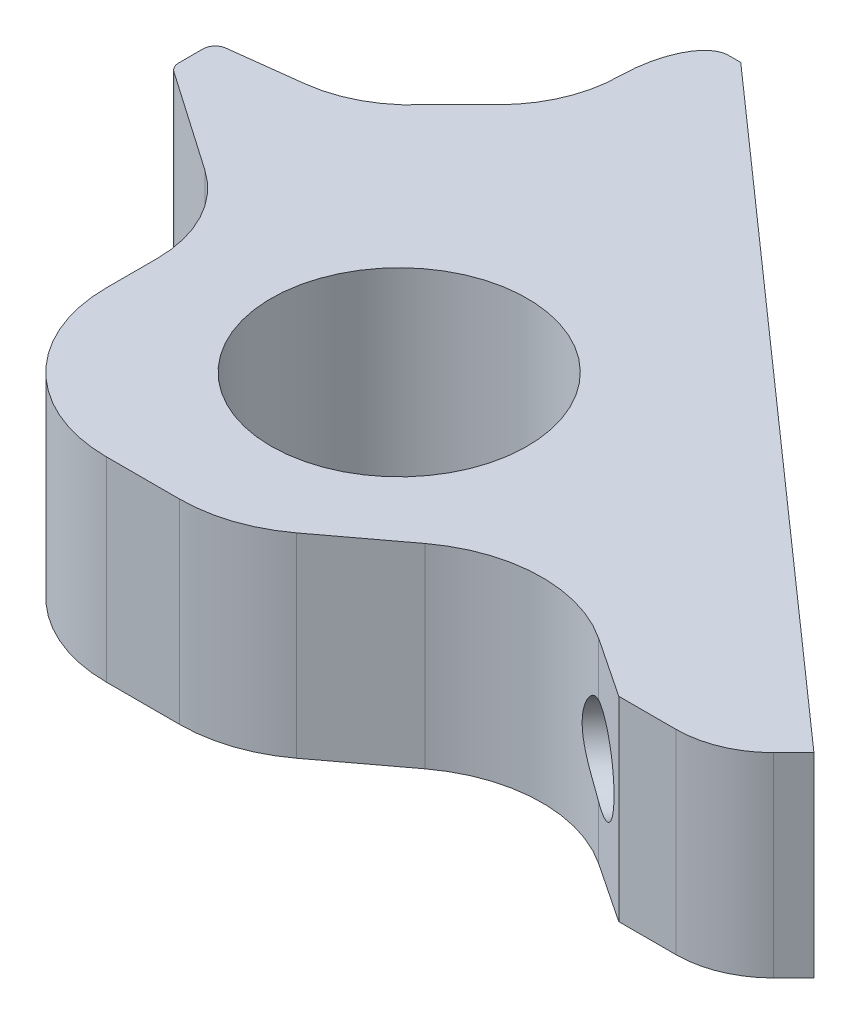
ISO-10303-21;
HEADER;
FILE_DESCRIPTION(('STEP AP214'),'2;1');
FILE_NAME('part.step','',(''),(''),'','','');
FILE_SCHEMA(('AUTOMOTIVE_DESIGN { 1 0 10303 214 1 1 1 1 }'));
ENDSEC;
DATA;
#1=APPLICATION_CONTEXT('core data for automotive mechanical design processes');
#2=APPLICATION_PROTOCOL_DEFINITION('international standard','automotive_design',2000,#1);
#3=PRODUCT_CONTEXT('',#1,'mechanical');
#4=PRODUCT('Part','Part','',(#3));
#5=PRODUCT_RELATED_PRODUCT_CATEGORY('part','',(#4));
#6=PRODUCT_DEFINITION_FORMATION('','',#4);
#7=PRODUCT_DEFINITION_CONTEXT('part definition',#1,'design');
#8=PRODUCT_DEFINITION('design','',#6,#7);
#9=PRODUCT_DEFINITION_SHAPE('','',#8);
#10=(LENGTH_UNIT() NAMED_UNIT(*) SI_UNIT(.MILLI.,.METRE.));
#11=(NAMED_UNIT(*) PLANE_ANGLE_UNIT() SI_UNIT($,.RADIAN.));
#12=(NAMED_UNIT(*) SI_UNIT($,.STERADIAN.) SOLID_ANGLE_UNIT());
#13=UNCERTAINTY_MEASURE_WITH_UNIT(LENGTH_MEASURE(1.E-05),#10,'distance_accuracy_value','');
#14=(GEOMETRIC_REPRESENTATION_CONTEXT(3) GLOBAL_UNCERTAINTY_ASSIGNED_CONTEXT((#13)) GLOBAL_UNIT_ASSIGNED_CONTEXT((#10,
#11,#12)) REPRESENTATION_CONTEXT('',''));
#15=CARTESIAN_POINT('',(0.,0.,0.));
#16=DIRECTION('',(0.,0.,1.));
#17=DIRECTION('',(1.,0.,0.));
#18=AXIS2_PLACEMENT_3D('',#15,#16,#17);
#19=CARTESIAN_POINT('',(0.,8.,0.));
#20=DIRECTION('',(0.,-1.,0.));
#21=DIRECTION('',(0.,0.,-1.));
#22=AXIS2_PLACEMENT_3D('',#19,#20,#21);
#23=PLANE('',#22);
#24=DIRECTION('',(1.,0.,0.));
#25=VECTOR('',#24,1.);
#26=CARTESIAN_POINT('',(20.,8.,7.));
#27=LINE('',#26,#25);
#28=CARTESIAN_POINT('',(16.,8.,7.));
#29=VERTEX_POINT('',#28);
#30=CARTESIAN_POINT('',(18.3431457505076,8.,7.));
#31=VERTEX_POINT('',#30);
#32=EDGE_CURVE('E487',#29,#31,#27,.T.);
#33=ORIENTED_EDGE('',*,*,#32,.T.);
#34=CARTESIAN_POINT('',(18.3431457505076,8.,3.));
#35=DIRECTION('',(0.,-1.,0.));
#36=DIRECTION('',(0.,0.,-1.));
#37=AXIS2_PLACEMENT_3D('',#34,#35,#36);
#38=CIRCLE('',#37,4.);
#39=CARTESIAN_POINT('',(21.1715728752538,8.,5.82842712474619));
#40=VERTEX_POINT('',#39);
#41=EDGE_CURVE('E12',#31,#40,#38,.F.);
#42=ORIENTED_EDGE('',*,*,#41,.T.);
#43=DIRECTION('',(0.707106781186547,0.,-0.707106781186548));
#44=VECTOR('',#43,1.);
#45=CARTESIAN_POINT('',(20.,8.,7.));
#46=LINE('',#45,#44);
#47=CARTESIAN_POINT('',(22.,8.,5.));
#48=VERTEX_POINT('',#47);
#49=EDGE_CURVE('E493',#40,#48,#46,.T.);
#50=ORIENTED_EDGE('',*,*,#49,.T.);
#51=DIRECTION('',(-0.748996562490381,0.,-0.662573882203029));
#52=VECTOR('',#51,1.);
#53=CARTESIAN_POINT('',(-4.,8.,-18.));
#54=LINE('',#53,#52);
#55=CARTESIAN_POINT('',(-4.,8.,-18.));
#56=VERTEX_POINT('',#55);
#57=EDGE_CURVE('E356',#48,#56,#54,.T.);
#58=ORIENTED_EDGE('',*,*,#57,.T.);
#59=DIRECTION('',(-1.,0.,0.));
#60=VECTOR('',#59,1.);
#61=CARTESIAN_POINT('',(-6.,8.,-18.));
#62=LINE('',#61,#60);
#63=CARTESIAN_POINT('',(-4.5,8.,-18.));
#64=VERTEX_POINT('',#63);
#65=EDGE_CURVE('E346',#56,#64,#62,.T.);
#66=ORIENTED_EDGE('',*,*,#65,.T.);
#67=CARTESIAN_POINT('',(-6.,8.,-15.));
#68=CARTESIAN_POINT('',(-6.,8.,-18.));
#69=CARTESIAN_POINT('',(-4.5,8.,-18.));
#70=(BOUNDED_CURVE() B_SPLINE_CURVE(2,(#67,#68,#69),.UNSPECIFIED.,.F.,
.F.) B_SPLINE_CURVE_WITH_KNOTS((3,3),(0.,1.),
.UNSPECIFIED.) CURVE() GEOMETRIC_REPRESENTATION_ITEM() RATIONAL_B_SPLINE_CURVE((1.,
0.707106781186548,1.)) REPRESENTATION_ITEM(''));
#71=CARTESIAN_POINT('',(-5.99987537465375,8.,-15.0388891972066));
#72=VERTEX_POINT('',#71);
#73=EDGE_CURVE('E332',#64,#72,#70,.F.);
#74=ORIENTED_EDGE('',*,*,#73,.T.);
#75=CARTESIAN_POINT('',(-10.9997689239918,8.,-15.0712988878737));
#76=DIRECTION('',(0.,-1.,0.));
#77=DIRECTION('',(0.,0.,-1.));
#78=AXIS2_PLACEMENT_3D('',#75,#76,#77);
#79=CIRCLE('',#78,5.);
#80=CARTESIAN_POINT('',(-7.46423501805903,8.,-11.535764981941));
#81=VERTEX_POINT('',#80);
#82=EDGE_CURVE('E406',#72,#81,#79,.T.);
#83=ORIENTED_EDGE('',*,*,#82,.T.);
#84=DIRECTION('',(-0.707106781186548,0.,0.707106781186547));
#85=VECTOR('',#84,1.);
#86=CARTESIAN_POINT('',(-9.00000000000001,8.,-10.));
#87=LINE('',#86,#85);
#88=CARTESIAN_POINT('',(-9.00000000000001,8.,-10.));
#89=VERTEX_POINT('',#88);
#90=EDGE_CURVE('E355',#81,#89,#87,.T.);
#91=ORIENTED_EDGE('',*,*,#90,.T.);
#92=CARTESIAN_POINT('',(-12.7794521093473,8.,-13.2734907595945));
#93=DIRECTION('',(0.,-1.,0.));
#94=DIRECTION('',(0.,0.,-1.));
#95=AXIS2_PLACEMENT_3D('',#92,#93,#94);
#96=CIRCLE('',#95,5.);
#97=CARTESIAN_POINT('',(-12.1701053923215,8.,-8.31076000138787));
#98=VERTEX_POINT('',#97);
#99=EDGE_CURVE('E440',#89,#98,#96,.T.);
#100=ORIENTED_EDGE('',*,*,#99,.T.);
#101=DIRECTION('',(0.992546151641322,0.,-0.121869343405148));
#102=VECTOR('',#101,1.);
#103=CARTESIAN_POINT('',(-15.5,8.,-7.90190035413112));
#104=LINE('',#103,#102);
#105=CARTESIAN_POINT('',(-15.0609346717026,8.,-7.95581079767381));
#106=VERTEX_POINT('',#105);
#107=EDGE_CURVE('E414',#98,#106,#104,.F.);
#108=ORIENTED_EDGE('',*,*,#107,.T.);
#109=CARTESIAN_POINT('',(-15.,8.,-7.45953772185315));
#110=DIRECTION('',(0.,-1.,0.));
#111=DIRECTION('',(0.,0.,-1.));
#112=AXIS2_PLACEMENT_3D('',#109,#110,#111);
#113=CIRCLE('',#112,0.5);
#114=CARTESIAN_POINT('',(-15.5,8.,-7.45953772185315));
#115=VERTEX_POINT('',#114);
#116=EDGE_CURVE('E454',#106,#115,#113,.F.);
#117=ORIENTED_EDGE('',*,*,#116,.T.);
#118=DIRECTION('',(0.,0.,1.));
#119=VECTOR('',#118,1.);
#120=CARTESIAN_POINT('',(-15.5,8.,-8.7));
#121=LINE('',#120,#119);
#122=CARTESIAN_POINT('',(-15.5,8.,-6.4619764731093));
#123=VERTEX_POINT('',#122);
#124=EDGE_CURVE('E390',#115,#123,#121,.T.);
#125=ORIENTED_EDGE('',*,*,#124,.T.);
#126=CARTESIAN_POINT('',(-15.,8.,-6.4619764731093));
#127=DIRECTION('',(0.,-1.,0.));
#128=DIRECTION('',(0.,0.,-1.));
#129=AXIS2_PLACEMENT_3D('',#126,#127,#128);
#130=CIRCLE('',#129,0.5);
#131=CARTESIAN_POINT('',(-15.2846049894152,8.,-6.05088037728741));
#132=VERTEX_POINT('',#131);
#133=EDGE_CURVE('E456',#123,#132,#130,.F.);
#134=ORIENTED_EDGE('',*,*,#133,.T.);
#135=DIRECTION('',(0.822192191643779,0.,0.569209978830308));
#136=VECTOR('',#135,1.);
#137=CARTESIAN_POINT('',(-15.5,8.,-6.2));
#138=LINE('',#137,#136);
#139=CARTESIAN_POINT('',(-11.1539501058485,8.,-3.19119622712585));
#140=VERTEX_POINT('',#139);
#141=EDGE_CURVE('E546',#132,#140,#138,.T.);
#142=ORIENTED_EDGE('',*,*,#141,.T.);
#143=CARTESIAN_POINT('',(-14.,8.,0.919764731093039));
#144=DIRECTION('',(0.,-1.,0.));
#145=DIRECTION('',(0.,0.,-1.));
#146=AXIS2_PLACEMENT_3D('',#143,#144,#145);
#147=CIRCLE('',#146,5.);
#148=CARTESIAN_POINT('',(-9.,8.,0.919764731093037));
#149=VERTEX_POINT('',#148);
#150=EDGE_CURVE('E436',#140,#149,#147,.T.);
#151=ORIENTED_EDGE('',*,*,#150,.T.);
#152=DIRECTION('',(0.,0.,1.));
#153=VECTOR('',#152,1.);
#154=CARTESIAN_POINT('',(-9.,8.,-1.7));
#155=LINE('',#154,#153);
#156=CARTESIAN_POINT('',(-9.,8.,3.));
#157=VERTEX_POINT('',#156);
#158=EDGE_CURVE('E489',#149,#157,#155,.T.);
#159=ORIENTED_EDGE('',*,*,#158,.T.);
#160=CARTESIAN_POINT('',(-3.,8.,3.));
#161=DIRECTION('',(0.,-1.,0.));
#162=DIRECTION('',(0.,0.,-1.));
#163=AXIS2_PLACEMENT_3D('',#160,#161,#162);
#164=CIRCLE('',#163,6.);
#165=CARTESIAN_POINT('',(-3.,8.,9.));
#166=VERTEX_POINT('',#165);
#167=EDGE_CURVE('E473',#157,#166,#164,.F.);
#168=ORIENTED_EDGE('',*,*,#167,.T.);
#169=DIRECTION('',(1.,0.,0.));
#170=VECTOR('',#169,1.);
#171=CARTESIAN_POINT('',(2.,8.,9.));
#172=LINE('',#171,#170);
#173=CARTESIAN_POINT('',(0.,8.,9.));
#174=VERTEX_POINT('',#173);
#175=EDGE_CURVE('E485',#166,#174,#172,.T.);
#176=ORIENTED_EDGE('',*,*,#175,.T.);
#177=CARTESIAN_POINT('',(0.,8.,3.));
#178=DIRECTION('',(0.,-1.,0.));
#179=DIRECTION('',(0.,0.,-1.));
#180=AXIS2_PLACEMENT_3D('',#177,#178,#179);
#181=CIRCLE('',#180,6.);
#182=CARTESIAN_POINT('',(3.6,8.,7.8));
#183=VERTEX_POINT('',#182);
#184=EDGE_CURVE('E471',#174,#183,#181,.F.);
#185=ORIENTED_EDGE('',*,*,#184,.T.);
#186=DIRECTION('',(0.8,0.,-0.6));
#187=VECTOR('',#186,1.);
#188=CARTESIAN_POINT('',(10.,8.,3.));
#189=LINE('',#188,#187);
#190=CARTESIAN_POINT('',(6.60392761110966,8.,5.54705429166775));
#191=VERTEX_POINT('',#190);
#192=EDGE_CURVE('E478',#183,#191,#189,.T.);
#193=ORIENTED_EDGE('',*,*,#192,.T.);
#194=CARTESIAN_POINT('',(10.2039276111097,8.,10.3470542916678));
#195=DIRECTION('',(0.,-1.,0.));
#196=DIRECTION('',(0.,0.,-1.));
#197=AXIS2_PLACEMENT_3D('',#194,#195,#196);
#198=CIRCLE('',#197,6.);
#199=CARTESIAN_POINT('',(13.532128788461,8.,5.35475252564069));
#200=VERTEX_POINT('',#199);
#201=EDGE_CURVE('E203',#191,#200,#198,.T.);
#202=ORIENTED_EDGE('',*,*,#201,.T.);
#203=DIRECTION('',(0.832050294337843,0.,0.554700196225229));
#204=VECTOR('',#203,1.);
#205=CARTESIAN_POINT('',(16.,8.,7.));
#206=LINE('',#205,#204);
#207=EDGE_CURVE('E484',#200,#29,#206,.T.);
#208=ORIENTED_EDGE('',*,*,#207,.T.);
#209=EDGE_LOOP('',(#33,#42,#50,#58,#66,#74,#83,#91,#100,#108,#117,#125,#134,#142,#151,#159,#168,
#176,#185,#193,#202,#208));
#210=FACE_BOUND('',#209,.T.);
#211=CARTESIAN_POINT('',(0.,8.,0.));
#212=DIRECTION('',(0.,1.,0.));
#213=DIRECTION('',(0.,0.,1.));
#214=AXIS2_PLACEMENT_3D('',#211,#212,#213);
#215=CIRCLE('',#214,5.25);
#216=CARTESIAN_POINT('',(0.,8.,5.25));
#217=VERTEX_POINT('',#216);
#218=EDGE_CURVE('E367',#217,#217,#215,.T.);
#219=ORIENTED_EDGE('',*,*,#218,.F.);
#220=EDGE_LOOP('',(#219));
#221=FACE_BOUND('',#220,.T.);
#222=ADVANCED_FACE('F40',(#210,#221),#23,.F.);
#223=CARTESIAN_POINT('',(0.,0.,0.));
#224=DIRECTION('',(0.,-1.,0.));
#225=DIRECTION('',(0.,0.,-1.));
#226=AXIS2_PLACEMENT_3D('',#223,#224,#225);
#227=PLANE('',#226);
#228=DIRECTION('',(0.707106781186547,0.,-0.707106781186548));
#229=VECTOR('',#228,1.);
#230=CARTESIAN_POINT('',(20.,0.,7.));
#231=LINE('',#230,#229);
#232=CARTESIAN_POINT('',(21.1715728752538,0.,5.82842712474619));
#233=VERTEX_POINT('',#232);
#234=CARTESIAN_POINT('',(22.,0.,5.));
#235=VERTEX_POINT('',#234);
#236=EDGE_CURVE('E382',#233,#235,#231,.T.);
#237=ORIENTED_EDGE('',*,*,#236,.F.);
#238=CARTESIAN_POINT('',(18.3431457505076,0.,3.));
#239=DIRECTION('',(0.,-1.,0.));
#240=DIRECTION('',(0.,0.,-1.));
#241=AXIS2_PLACEMENT_3D('',#238,#239,#240);
#242=CIRCLE('',#241,4.);
#243=CARTESIAN_POINT('',(18.3431457505076,0.,7.));
#244=VERTEX_POINT('',#243);
#245=EDGE_CURVE('E62',#233,#244,#242,.T.);
#246=ORIENTED_EDGE('',*,*,#245,.T.);
#247=DIRECTION('',(1.,0.,0.));
#248=VECTOR('',#247,1.);
#249=CARTESIAN_POINT('',(20.,0.,7.));
#250=LINE('',#249,#248);
#251=CARTESIAN_POINT('',(16.,0.,7.));
#252=VERTEX_POINT('',#251);
#253=EDGE_CURVE('E380',#252,#244,#250,.T.);
#254=ORIENTED_EDGE('',*,*,#253,.F.);
#255=DIRECTION('',(0.832050294337843,0.,0.554700196225229));
#256=VECTOR('',#255,1.);
#257=CARTESIAN_POINT('',(16.,0.,7.));
#258=LINE('',#257,#256);
#259=CARTESIAN_POINT('',(13.532128788461,0.,5.35475252564069));
#260=VERTEX_POINT('',#259);
#261=EDGE_CURVE('E378',#260,#252,#258,.T.);
#262=ORIENTED_EDGE('',*,*,#261,.F.);
#263=CARTESIAN_POINT('',(10.2039276111097,0.,10.3470542916678));
#264=DIRECTION('',(0.,-1.,0.));
#265=DIRECTION('',(0.,0.,-1.));
#266=AXIS2_PLACEMENT_3D('',#263,#264,#265);
#267=CIRCLE('',#266,6.);
#268=CARTESIAN_POINT('',(6.60392761110966,0.,5.54705429166775));
#269=VERTEX_POINT('',#268);
#270=EDGE_CURVE('E216',#260,#269,#267,.F.);
#271=ORIENTED_EDGE('',*,*,#270,.T.);
#272=DIRECTION('',(0.8,0.,-0.6));
#273=VECTOR('',#272,1.);
#274=CARTESIAN_POINT('',(10.,0.,3.));
#275=LINE('',#274,#273);
#276=CARTESIAN_POINT('',(3.6,0.,7.8));
#277=VERTEX_POINT('',#276);
#278=EDGE_CURVE('E375',#277,#269,#275,.T.);
#279=ORIENTED_EDGE('',*,*,#278,.F.);
#280=CARTESIAN_POINT('',(0.,0.,3.));
#281=DIRECTION('',(0.,-1.,0.));
#282=DIRECTION('',(0.,0.,-1.));
#283=AXIS2_PLACEMENT_3D('',#280,#281,#282);
#284=CIRCLE('',#283,6.);
#285=CARTESIAN_POINT('',(0.,0.,9.));
#286=VERTEX_POINT('',#285);
#287=EDGE_CURVE('E465',#277,#286,#284,.T.);
#288=ORIENTED_EDGE('',*,*,#287,.T.);
#289=DIRECTION('',(1.,0.,0.));
#290=VECTOR('',#289,1.);
#291=CARTESIAN_POINT('',(2.,0.,9.));
#292=LINE('',#291,#290);
#293=CARTESIAN_POINT('',(-3.,0.,9.));
#294=VERTEX_POINT('',#293);
#295=EDGE_CURVE('E372',#294,#286,#292,.T.);
#296=ORIENTED_EDGE('',*,*,#295,.F.);
#297=CARTESIAN_POINT('',(-3.,0.,3.));
#298=DIRECTION('',(0.,-1.,0.));
#299=DIRECTION('',(0.,0.,-1.));
#300=AXIS2_PLACEMENT_3D('',#297,#298,#299);
#301=CIRCLE('',#300,6.);
#302=CARTESIAN_POINT('',(-9.,0.,3.));
#303=VERTEX_POINT('',#302);
#304=EDGE_CURVE('E467',#294,#303,#301,.T.);
#305=ORIENTED_EDGE('',*,*,#304,.T.);
#306=DIRECTION('',(0.,0.,1.));
#307=VECTOR('',#306,1.);
#308=CARTESIAN_POINT('',(-9.,0.,-1.7));
#309=LINE('',#308,#307);
#310=CARTESIAN_POINT('',(-9.,0.,0.919764731093037));
#311=VERTEX_POINT('',#310);
#312=EDGE_CURVE('E369',#311,#303,#309,.T.);
#313=ORIENTED_EDGE('',*,*,#312,.F.);
#314=CARTESIAN_POINT('',(-14.,0.,0.919764731093039));
#315=DIRECTION('',(0.,-1.,0.));
#316=DIRECTION('',(0.,0.,-1.));
#317=AXIS2_PLACEMENT_3D('',#314,#315,#316);
#318=CIRCLE('',#317,5.);
#319=CARTESIAN_POINT('',(-11.1539501058485,0.,-3.19119622712585));
#320=VERTEX_POINT('',#319);
#321=EDGE_CURVE('E433',#311,#320,#318,.F.);
#322=ORIENTED_EDGE('',*,*,#321,.T.);
#323=DIRECTION('',(0.822192191643779,0.,0.569209978830308));
#324=VECTOR('',#323,1.);
#325=CARTESIAN_POINT('',(-15.5,0.,-6.2));
#326=LINE('',#325,#324);
#327=CARTESIAN_POINT('',(-15.2846049894152,0.,-6.05088037728741));
#328=VERTEX_POINT('',#327);
#329=EDGE_CURVE('E366',#328,#320,#326,.T.);
#330=ORIENTED_EDGE('',*,*,#329,.F.);
#331=CARTESIAN_POINT('',(-15.,0.,-6.4619764731093));
#332=DIRECTION('',(0.,-1.,0.));
#333=DIRECTION('',(0.,0.,-1.));
#334=AXIS2_PLACEMENT_3D('',#331,#332,#333);
#335=CIRCLE('',#334,0.5);
#336=CARTESIAN_POINT('',(-15.5,0.,-6.4619764731093));
#337=VERTEX_POINT('',#336);
#338=EDGE_CURVE('E447',#328,#337,#335,.T.);
#339=ORIENTED_EDGE('',*,*,#338,.T.);
#340=DIRECTION('',(0.,0.,1.));
#341=VECTOR('',#340,1.);
#342=CARTESIAN_POINT('',(-15.5,0.,-8.7));
#343=LINE('',#342,#341);
#344=CARTESIAN_POINT('',(-15.5,0.,-7.45953772185315));
#345=VERTEX_POINT('',#344);
#346=EDGE_CURVE('E363',#345,#337,#343,.T.);
#347=ORIENTED_EDGE('',*,*,#346,.F.);
#348=CARTESIAN_POINT('',(-15.,0.,-7.45953772185315));
#349=DIRECTION('',(0.,-1.,0.));
#350=DIRECTION('',(0.,0.,-1.));
#351=AXIS2_PLACEMENT_3D('',#348,#349,#350);
#352=CIRCLE('',#351,0.5);
#353=CARTESIAN_POINT('',(-15.0609346717026,0.,-7.95581079767381));
#354=VERTEX_POINT('',#353);
#355=EDGE_CURVE('E445',#345,#354,#352,.T.);
#356=ORIENTED_EDGE('',*,*,#355,.T.);
#357=DIRECTION('',(-0.992546151641322,0.,0.121869343405148));
#358=VECTOR('',#357,1.);
#359=CARTESIAN_POINT('',(-1.18602947761658,0.,-9.65943493949909));
#360=LINE('',#359,#358);
#361=CARTESIAN_POINT('',(-12.1701053923215,0.,-8.31076000138787));
#362=VERTEX_POINT('',#361);
#363=EDGE_CURVE('E411',#354,#362,#360,.F.);
#364=ORIENTED_EDGE('',*,*,#363,.T.);
#365=CARTESIAN_POINT('',(-12.7794521093473,0.,-13.2734907595945));
#366=DIRECTION('',(0.,-1.,0.));
#367=DIRECTION('',(0.,0.,-1.));
#368=AXIS2_PLACEMENT_3D('',#365,#366,#367);
#369=CIRCLE('',#368,5.);
#370=CARTESIAN_POINT('',(-9.00000000000001,0.,-10.));
#371=VERTEX_POINT('',#370);
#372=EDGE_CURVE('E438',#362,#371,#369,.F.);
#373=ORIENTED_EDGE('',*,*,#372,.T.);
#374=DIRECTION('',(-0.707106781186548,0.,0.707106781186547));
#375=VECTOR('',#374,1.);
#376=CARTESIAN_POINT('',(-9.00000000000001,0.,-10.));
#377=LINE('',#376,#375);
#378=CARTESIAN_POINT('',(-7.46423501805903,0.,-11.535764981941));
#379=VERTEX_POINT('',#378);
#380=EDGE_CURVE('E387',#379,#371,#377,.T.);
#381=ORIENTED_EDGE('',*,*,#380,.F.);
#382=CARTESIAN_POINT('',(-10.9997689239918,0.,-15.0712988878737));
#383=DIRECTION('',(0.,-1.,0.));
#384=DIRECTION('',(0.,0.,-1.));
#385=AXIS2_PLACEMENT_3D('',#382,#383,#384);
#386=CIRCLE('',#385,5.);
#387=CARTESIAN_POINT('',(-5.99987522622822,0.,-15.0388891963235));
#388=VERTEX_POINT('',#387);
#389=EDGE_CURVE('E412',#379,#388,#386,.F.);
#390=ORIENTED_EDGE('',*,*,#389,.T.);
#391=CARTESIAN_POINT('',(-4.5,0.,-18.));
#392=CARTESIAN_POINT('',(-6.,0.,-18.));
#393=CARTESIAN_POINT('',(-6.,0.,-15.));
#394=(BOUNDED_CURVE() B_SPLINE_CURVE(2,(#391,#392,#393),.UNSPECIFIED.,.F.,
.F.) B_SPLINE_CURVE_WITH_KNOTS((3,3),(0.,1.),
.UNSPECIFIED.) CURVE() GEOMETRIC_REPRESENTATION_ITEM() RATIONAL_B_SPLINE_CURVE((1.,
0.707106781186548,1.)) REPRESENTATION_ITEM(''));
#395=CARTESIAN_POINT('',(-4.5,0.,-18.));
#396=VERTEX_POINT('',#395);
#397=EDGE_CURVE('E336',#388,#396,#394,.F.);
#398=ORIENTED_EDGE('',*,*,#397,.T.);
#399=DIRECTION('',(-1.,0.,0.));
#400=VECTOR('',#399,1.);
#401=CARTESIAN_POINT('',(-6.,0.,-18.));
#402=LINE('',#401,#400);
#403=CARTESIAN_POINT('',(-4.,0.,-18.));
#404=VERTEX_POINT('',#403);
#405=EDGE_CURVE('E343',#404,#396,#402,.T.);
#406=ORIENTED_EDGE('',*,*,#405,.F.);
#407=DIRECTION('',(-0.748996562490381,0.,-0.662573882203029));
#408=VECTOR('',#407,1.);
#409=CARTESIAN_POINT('',(-4.,0.,-18.));
#410=LINE('',#409,#408);
#411=EDGE_CURVE('E384',#235,#404,#410,.T.);
#412=ORIENTED_EDGE('',*,*,#411,.F.);
#413=EDGE_LOOP('',(#237,#246,#254,#262,#271,#279,#288,#296,#305,#313,#322,#330,#339,#347,#356,
#364,#373,#381,#390,#398,#406,#412));
#414=FACE_BOUND('',#413,.T.);
#415=CARTESIAN_POINT('',(0.,0.,0.));
#416=DIRECTION('',(0.,1.,0.));
#417=DIRECTION('',(0.,0.,1.));
#418=AXIS2_PLACEMENT_3D('',#415,#416,#417);
#419=CIRCLE('',#418,5.25);
#420=CARTESIAN_POINT('',(0.,0.,5.25));
#421=VERTEX_POINT('',#420);
#422=EDGE_CURVE('E211',#421,#421,#419,.T.);
#423=ORIENTED_EDGE('',*,*,#422,.T.);
#424=EDGE_LOOP('',(#423));
#425=FACE_BOUND('',#424,.T.);
#426=ADVANCED_FACE('F250',(#414,#425),#227,.T.);
#427=CARTESIAN_POINT('',(-15.5,8.,-8.7));
#428=DIRECTION('',(1.,0.,0.));
#429=DIRECTION('',(0.,0.,-1.));
#430=AXIS2_PLACEMENT_3D('',#427,#428,#429);
#431=PLANE('',#430);
#432=ORIENTED_EDGE('',*,*,#346,.T.);
#433=DIRECTION('',(0.,-1.,0.));
#434=VECTOR('',#433,1.);
#435=CARTESIAN_POINT('',(-15.5,8.,-6.4619764731093));
#436=LINE('',#435,#434);
#437=EDGE_CURVE('E452',#337,#123,#436,.F.);
#438=ORIENTED_EDGE('',*,*,#437,.T.);
#439=ORIENTED_EDGE('',*,*,#124,.F.);
#440=DIRECTION('',(0.,1.,0.));
#441=VECTOR('',#440,1.);
#442=CARTESIAN_POINT('',(-15.5,0.,-7.45953772185315));
#443=LINE('',#442,#441);
#444=EDGE_CURVE('E449',#115,#345,#443,.F.);
#445=ORIENTED_EDGE('',*,*,#444,.T.);
#446=EDGE_LOOP('',(#432,#438,#439,#445));
#447=FACE_BOUND('',#446,.T.);
#448=ADVANCED_FACE('F289',(#447),#431,.F.);
#449=CARTESIAN_POINT('',(-15.5,8.,-6.2));
#450=DIRECTION('',(0.569209978830308,0.,-0.822192191643779));
#451=DIRECTION('',(-0.822192191643779,0.,-0.569209978830308));
#452=AXIS2_PLACEMENT_3D('',#449,#450,#451);
#453=PLANE('',#452);
#454=ORIENTED_EDGE('',*,*,#141,.F.);
#455=DIRECTION('',(0.,-1.,0.));
#456=VECTOR('',#455,1.);
#457=CARTESIAN_POINT('',(-15.2846049894152,8.,-6.05088037728741));
#458=LINE('',#457,#456);
#459=EDGE_CURVE('E442',#132,#328,#458,.T.);
#460=ORIENTED_EDGE('',*,*,#459,.T.);
#461=ORIENTED_EDGE('',*,*,#329,.T.);
#462=DIRECTION('',(0.,-1.,0.));
#463=VECTOR('',#462,1.);
#464=CARTESIAN_POINT('',(-11.1539501058485,8.,-3.19119622712585));
#465=LINE('',#464,#463);
#466=EDGE_CURVE('E427',#320,#140,#465,.F.);
#467=ORIENTED_EDGE('',*,*,#466,.T.);
#468=EDGE_LOOP('',(#454,#460,#461,#467));
#469=FACE_BOUND('',#468,.T.);
#470=ADVANCED_FACE('F537',(#469),#453,.F.);
#471=CARTESIAN_POINT('',(-9.,8.,-1.7));
#472=DIRECTION('',(1.,0.,0.));
#473=DIRECTION('',(0.,0.,-1.));
#474=AXIS2_PLACEMENT_3D('',#471,#472,#473);
#475=PLANE('',#474);
#476=ORIENTED_EDGE('',*,*,#312,.T.);
#477=DIRECTION('',(0.,-1.,0.));
#478=VECTOR('',#477,1.);
#479=CARTESIAN_POINT('',(-9.,8.,3.));
#480=LINE('',#479,#478);
#481=EDGE_CURVE('E469',#303,#157,#480,.F.);
#482=ORIENTED_EDGE('',*,*,#481,.T.);
#483=ORIENTED_EDGE('',*,*,#158,.F.);
#484=DIRECTION('',(0.,-1.,0.));
#485=VECTOR('',#484,1.);
#486=CARTESIAN_POINT('',(-9.,0.,0.919764731093037));
#487=LINE('',#486,#485);
#488=EDGE_CURVE('E424',#149,#311,#487,.T.);
#489=ORIENTED_EDGE('',*,*,#488,.T.);
#490=EDGE_LOOP('',(#476,#482,#483,#489));
#491=FACE_BOUND('',#490,.T.);
#492=ADVANCED_FACE('F534',(#491),#475,.F.);
#493=CARTESIAN_POINT('',(2.,8.,9.));
#494=DIRECTION('',(0.,0.,-1.));
#495=DIRECTION('',(-1.,0.,0.));
#496=AXIS2_PLACEMENT_3D('',#493,#494,#495);
#497=PLANE('',#496);
#498=ORIENTED_EDGE('',*,*,#175,.F.);
#499=DIRECTION('',(0.,-1.,0.));
#500=VECTOR('',#499,1.);
#501=CARTESIAN_POINT('',(-3.,8.,9.));
#502=LINE('',#501,#500);
#503=EDGE_CURVE('E462',#166,#294,#502,.T.);
#504=ORIENTED_EDGE('',*,*,#503,.T.);
#505=ORIENTED_EDGE('',*,*,#295,.T.);
#506=DIRECTION('',(0.,-1.,0.));
#507=VECTOR('',#506,1.);
#508=CARTESIAN_POINT('',(0.,8.,9.));
#509=LINE('',#508,#507);
#510=EDGE_CURVE('E460',#286,#174,#509,.F.);
#511=ORIENTED_EDGE('',*,*,#510,.T.);
#512=EDGE_LOOP('',(#498,#504,#505,#511));
#513=FACE_BOUND('',#512,.T.);
#514=ADVANCED_FACE('F531',(#513),#497,.F.);
#515=CARTESIAN_POINT('',(10.,8.,3.));
#516=DIRECTION('',(-0.6,0.,-0.8));
#517=DIRECTION('',(-0.8,0.,0.6));
#518=AXIS2_PLACEMENT_3D('',#515,#516,#517);
#519=PLANE('',#518);
#520=ORIENTED_EDGE('',*,*,#192,.F.);
#521=DIRECTION('',(0.,-1.,0.));
#522=VECTOR('',#521,1.);
#523=CARTESIAN_POINT('',(3.6,8.,7.8));
#524=LINE('',#523,#522);
#525=EDGE_CURVE('E218',#183,#277,#524,.T.);
#526=ORIENTED_EDGE('',*,*,#525,.T.);
#527=ORIENTED_EDGE('',*,*,#278,.T.);
#528=DIRECTION('',(0.,-1.,0.));
#529=VECTOR('',#528,1.);
#530=CARTESIAN_POINT('',(6.60392761110966,8.,5.54705429166775));
#531=LINE('',#530,#529);
#532=EDGE_CURVE('E221',#269,#191,#531,.F.);
#533=ORIENTED_EDGE('',*,*,#532,.T.);
#534=EDGE_LOOP('',(#520,#526,#527,#533));
#535=FACE_BOUND('',#534,.T.);
#536=ADVANCED_FACE('F477',(#535),#519,.F.);
#537=CARTESIAN_POINT('',(16.,8.,7.));
#538=DIRECTION('',(0.554700196225229,0.,-0.832050294337844));
#539=DIRECTION('',(-0.832050294337844,0.,-0.554700196225229));
#540=AXIS2_PLACEMENT_3D('',#537,#538,#539);
#541=PLANE('',#540);
#542=DIRECTION('',(0.,-1.,0.));
#543=VECTOR('',#542,1.);
#544=CARTESIAN_POINT('',(13.532128788461,0.,5.35475252564069));
#545=LINE('',#544,#543);
#546=CARTESIAN_POINT('',(13.532128788461,5.807503664112,5.35475252564069));
#547=VERTEX_POINT('',#546);
#548=EDGE_CURVE('E210',#200,#547,#545,.T.);
#549=ORIENTED_EDGE('',*,*,#548,.T.);
#550=CARTESIAN_POINT('',(13.8632303438831,4.,5.57548689592205));
#551=DIRECTION('',(0.554700196225229,0.,-0.832050294337844));
#552=DIRECTION('',(0.832050294337844,0.,0.554700196225229));
#553=AXIS2_PLACEMENT_3D('',#550,#551,#552);
#554=ELLIPSE('',#553,1.86730492582336,1.85);
#555=CARTESIAN_POINT('',(13.532128788461,2.192496335888,5.35475252564069));
#556=VERTEX_POINT('',#555);
#557=EDGE_CURVE('E197',#547,#556,#554,.T.);
#558=ORIENTED_EDGE('',*,*,#557,.T.);
#559=EDGE_CURVE('E207',#556,#260,#545,.T.);
#560=ORIENTED_EDGE('',*,*,#559,.T.);
#561=ORIENTED_EDGE('',*,*,#261,.T.);
#562=DIRECTION('',(0.,-1.,0.));
#563=VECTOR('',#562,1.);
#564=CARTESIAN_POINT('',(16.,8.,7.));
#565=LINE('',#564,#563);
#566=EDGE_CURVE('E398',#29,#252,#565,.T.);
#567=ORIENTED_EDGE('',*,*,#566,.F.);
#568=ORIENTED_EDGE('',*,*,#207,.F.);
#569=EDGE_LOOP('',(#549,#558,#560,#561,#567,#568));
#570=FACE_BOUND('',#569,.T.);
#571=ADVANCED_FACE('F206',(#570),#541,.F.);
#572=CARTESIAN_POINT('',(20.,8.,7.));
#573=DIRECTION('',(0.,0.,-1.));
#574=DIRECTION('',(-1.,0.,0.));
#575=AXIS2_PLACEMENT_3D('',#572,#573,#574);
#576=PLANE('',#575);
#577=ORIENTED_EDGE('',*,*,#253,.T.);
#578=DIRECTION('',(0.,-1.,0.));
#579=VECTOR('',#578,1.);
#580=CARTESIAN_POINT('',(18.3431457505076,8.,7.));
#581=LINE('',#580,#579);
#582=EDGE_CURVE('E48',#244,#31,#581,.F.);
#583=ORIENTED_EDGE('',*,*,#582,.T.);
#584=ORIENTED_EDGE('',*,*,#32,.F.);
#585=ORIENTED_EDGE('',*,*,#566,.T.);
#586=EDGE_LOOP('',(#577,#583,#584,#585));
#587=FACE_BOUND('',#586,.T.);
#588=ADVANCED_FACE('F523',(#587),#576,.F.);
#589=CARTESIAN_POINT('',(20.,8.,7.));
#590=DIRECTION('',(-0.707106781186548,0.,-0.707106781186547));
#591=DIRECTION('',(-0.707106781186547,0.,0.707106781186548));
#592=AXIS2_PLACEMENT_3D('',#589,#590,#591);
#593=PLANE('',#592);
#594=ORIENTED_EDGE('',*,*,#49,.F.);
#595=DIRECTION('',(0.,-1.,0.));
#596=VECTOR('',#595,1.);
#597=CARTESIAN_POINT('',(21.1715728752538,8.,5.82842712474619));
#598=LINE('',#597,#596);
#599=EDGE_CURVE('E202',#40,#233,#598,.T.);
#600=ORIENTED_EDGE('',*,*,#599,.T.);
#601=ORIENTED_EDGE('',*,*,#236,.T.);
#602=DIRECTION('',(0.,-1.,0.));
#603=VECTOR('',#602,1.);
#604=CARTESIAN_POINT('',(22.,8.,5.));
#605=LINE('',#604,#603);
#606=EDGE_CURVE('E396',#48,#235,#605,.T.);
#607=ORIENTED_EDGE('',*,*,#606,.F.);
#608=EDGE_LOOP('',(#594,#600,#601,#607));
#609=FACE_BOUND('',#608,.T.);
#610=ADVANCED_FACE('F509',(#609),#593,.F.);
#611=CARTESIAN_POINT('',(-4.,8.,-18.));
#612=DIRECTION('',(-0.662573882203029,0.,0.748996562490381));
#613=DIRECTION('',(0.748996562490381,0.,0.662573882203029));
#614=AXIS2_PLACEMENT_3D('',#611,#612,#613);
#615=PLANE('',#614);
#616=CARTESIAN_POINT('',(1.24297593743266,4.,-13.3619828245788));
#617=DIRECTION('',(0.662573882203029,0.,-0.748996562490381));
#618=DIRECTION('',(-0.748996562490381,0.,-0.662573882203029));
#619=AXIS2_PLACEMENT_3D('',#616,#617,#618);
#620=CIRCLE('',#619,1.85);
#621=CARTESIAN_POINT('',(-0.142667703174542,4.,-14.5877445066544));
#622=VERTEX_POINT('',#621);
#623=EDGE_CURVE('E779',#622,#622,#620,.T.);
#624=ORIENTED_EDGE('',*,*,#623,.F.);
#625=EDGE_LOOP('',(#624));
#626=FACE_BOUND('',#625,.T.);
#627=CARTESIAN_POINT('',(17.720900312221,4.,1.21464258388784));
#628=DIRECTION('',(0.662573882203029,0.,-0.748996562490381));
#629=DIRECTION('',(-0.748996562490381,0.,-0.662573882203029));
#630=AXIS2_PLACEMENT_3D('',#627,#628,#629);
#631=CIRCLE('',#630,1.85);
#632=CARTESIAN_POINT('',(16.3352566716138,4.,-0.0111190981877665));
#633=VERTEX_POINT('',#632);
#634=EDGE_CURVE('E782',#633,#633,#631,.T.);
#635=ORIENTED_EDGE('',*,*,#634,.F.);
#636=EDGE_LOOP('',(#635));
#637=FACE_BOUND('',#636,.T.);
#638=ORIENTED_EDGE('',*,*,#411,.T.);
#639=DIRECTION('',(0.,-1.,0.));
#640=VECTOR('',#639,1.);
#641=CARTESIAN_POINT('',(-4.,8.,-18.));
#642=LINE('',#641,#640);
#643=EDGE_CURVE('E393',#56,#404,#642,.T.);
#644=ORIENTED_EDGE('',*,*,#643,.F.);
#645=ORIENTED_EDGE('',*,*,#57,.F.);
#646=ORIENTED_EDGE('',*,*,#606,.T.);
#647=EDGE_LOOP('',(#638,#644,#645,#646));
#648=FACE_BOUND('',#647,.T.);
#649=ADVANCED_FACE('F499',(#626,#637,#648),#615,.F.);
#650=CARTESIAN_POINT('',(-6.,8.,-18.));
#651=DIRECTION('',(0.,0.,1.));
#652=DIRECTION('',(1.,0.,0.));
#653=AXIS2_PLACEMENT_3D('',#650,#651,#652);
#654=PLANE('',#653);
#655=ORIENTED_EDGE('',*,*,#405,.T.);
#656=CARTESIAN_POINT('',(-4.5,8.4,-18.));
#657=CARTESIAN_POINT('',(-4.5,5.46666666666667,-18.));
#658=CARTESIAN_POINT('',(-4.5,2.53333333333333,-18.));
#659=CARTESIAN_POINT('',(-4.5,-0.400000000000001,-18.));
#660=(BOUNDED_CURVE() B_SPLINE_CURVE(3,(#656,#657,#658,#659),.UNSPECIFIED.,.F.,
.F.) B_SPLINE_CURVE_WITH_KNOTS((4,4),(-0.0004,0.0084),
.UNSPECIFIED.) CURVE() GEOMETRIC_REPRESENTATION_ITEM() RATIONAL_B_SPLINE_CURVE((1.,1.,1.,1.)) REPRESENTATION_ITEM(''));
#661=EDGE_CURVE('E401',#396,#64,#660,.F.);
#662=ORIENTED_EDGE('',*,*,#661,.T.);
#663=ORIENTED_EDGE('',*,*,#65,.F.);
#664=ORIENTED_EDGE('',*,*,#643,.T.);
#665=EDGE_LOOP('',(#655,#662,#663,#664));
#666=FACE_BOUND('',#665,.T.);
#667=ADVANCED_FACE('F501',(#666),#654,.F.);
#668=CARTESIAN_POINT('',(-9.00000000000001,8.,-10.));
#669=DIRECTION('',(0.707106781186547,0.,0.707106781186548));
#670=DIRECTION('',(0.707106781186548,0.,-0.707106781186547));
#671=AXIS2_PLACEMENT_3D('',#668,#669,#670);
#672=PLANE('',#671);
#673=ORIENTED_EDGE('',*,*,#90,.F.);
#674=DIRECTION('',(0.,-1.,0.));
#675=VECTOR('',#674,1.);
#676=CARTESIAN_POINT('',(-7.46423501805903,8.,-11.535764981941));
#677=LINE('',#676,#675);
#678=EDGE_CURVE('E323',#81,#379,#677,.T.);
#679=ORIENTED_EDGE('',*,*,#678,.T.);
#680=ORIENTED_EDGE('',*,*,#380,.T.);
#681=DIRECTION('',(0.,-1.,0.));
#682=VECTOR('',#681,1.);
#683=CARTESIAN_POINT('',(-9.00000000000001,8.,-10.));
#684=LINE('',#683,#682);
#685=EDGE_CURVE('E362',#89,#371,#684,.T.);
#686=ORIENTED_EDGE('',*,*,#685,.F.);
#687=EDGE_LOOP('',(#673,#679,#680,#686));
#688=FACE_BOUND('',#687,.T.);
#689=ADVANCED_FACE('F245',(#688),#672,.F.);
#690=CARTESIAN_POINT('',(0.,8.,0.));
#691=DIRECTION('',(0.,-1.,0.));
#692=DIRECTION('',(0.,0.,-1.));
#693=AXIS2_PLACEMENT_3D('',#690,#691,#692);
#694=CYLINDRICAL_SURFACE('',#693,5.25);
#695=ORIENTED_EDGE('',*,*,#218,.T.);
#696=EDGE_LOOP('',(#695));
#697=FACE_BOUND('',#696,.T.);
#698=ORIENTED_EDGE('',*,*,#422,.F.);
#699=EDGE_LOOP('',(#698));
#700=FACE_BOUND('',#699,.T.);
#701=ADVANCED_FACE('F241',(#697,#700),#694,.F.);
#702=CARTESIAN_POINT('',(-6.,8.4,-15.));
#703=CARTESIAN_POINT('',(-6.,5.46666666666667,-15.));
#704=CARTESIAN_POINT('',(-6.,2.53333333333333,-15.));
#705=CARTESIAN_POINT('',(-6.,-0.400000000000001,-15.));
#706=CARTESIAN_POINT('',(-6.,8.4,-18.));
#707=CARTESIAN_POINT('',(-6.,5.46666666666667,-18.));
#708=CARTESIAN_POINT('',(-6.,2.53333333333333,-18.));
#709=CARTESIAN_POINT('',(-6.,-0.400000000000001,-18.));
#710=CARTESIAN_POINT('',(-4.5,8.4,-18.));
#711=CARTESIAN_POINT('',(-4.5,5.46666666666667,-18.));
#712=CARTESIAN_POINT('',(-4.5,2.53333333333333,-18.));
#713=CARTESIAN_POINT('',(-4.5,-0.400000000000001,-18.));
#714=(BOUNDED_SURFACE() B_SPLINE_SURFACE(2,3,((#702,#703,#704,#705),(#706,#707,#708,#709),(#710,
#711,#712,#713)),.UNSPECIFIED.,.F.,.F.,.F.) B_SPLINE_SURFACE_WITH_KNOTS((3,3),(4,4),(0.,1.),
(-0.0004,0.0084),.UNSPECIFIED.) GEOMETRIC_REPRESENTATION_ITEM() RATIONAL_B_SPLINE_SURFACE(((1.,
1.,1.,1.),(0.707106781186548,0.707106781186548,0.707106781186548,0.707106781186548),(1.,1.,1.,1.))) REPRESENTATION_ITEM('') SURFACE());
#715=DIRECTION('',(0.,-1.,0.));
#716=VECTOR('',#715,1.);
#717=CARTESIAN_POINT('',(-5.99987396395675,0.,-15.0388891884546));
#718=LINE('',#717,#716);
#719=EDGE_CURVE('E331',#388,#72,#718,.F.);
#720=ORIENTED_EDGE('',*,*,#397,.F.);
#721=ORIENTED_EDGE('',*,*,#719,.T.);
#722=ORIENTED_EDGE('',*,*,#73,.F.);
#723=ORIENTED_EDGE('',*,*,#661,.F.);
#724=EDGE_LOOP('',(#720,#721,#722,#723));
#725=FACE_BOUND('',#724,.T.);
#726=ADVANCED_FACE('F244',(#725),#714,.T.);
#727=CARTESIAN_POINT('',(-10.9997689239918,4.,-15.0712988878737));
#728=DIRECTION('',(0.,-1.,0.));
#729=DIRECTION('',(0.,0.,-1.));
#730=AXIS2_PLACEMENT_3D('',#727,#728,#729);
#731=CYLINDRICAL_SURFACE('',#730,5.);
#732=ORIENTED_EDGE('',*,*,#82,.F.);
#733=ORIENTED_EDGE('',*,*,#719,.F.);
#734=ORIENTED_EDGE('',*,*,#389,.F.);
#735=ORIENTED_EDGE('',*,*,#678,.F.);
#736=EDGE_LOOP('',(#732,#733,#734,#735));
#737=FACE_BOUND('',#736,.T.);
#738=ADVANCED_FACE('F287',(#737),#731,.F.);
#739=CARTESIAN_POINT('',(-15.5,8.,-7.90190035413112));
#740=DIRECTION('',(0.121869343405148,0.,0.992546151641322));
#741=DIRECTION('',(0.,-1.,0.));
#742=AXIS2_PLACEMENT_3D('',#739,#740,#741);
#743=PLANE('',#742);
#744=ORIENTED_EDGE('',*,*,#363,.F.);
#745=DIRECTION('',(0.,-1.,0.));
#746=VECTOR('',#745,1.);
#747=CARTESIAN_POINT('',(-15.0609346717026,8.,-7.95581079767381));
#748=LINE('',#747,#746);
#749=EDGE_CURVE('E458',#354,#106,#748,.F.);
#750=ORIENTED_EDGE('',*,*,#749,.T.);
#751=ORIENTED_EDGE('',*,*,#107,.F.);
#752=DIRECTION('',(0.,-1.,0.));
#753=VECTOR('',#752,1.);
#754=CARTESIAN_POINT('',(-12.1701053923215,0.,-8.31076000138787));
#755=LINE('',#754,#753);
#756=EDGE_CURVE('E430',#98,#362,#755,.T.);
#757=ORIENTED_EDGE('',*,*,#756,.T.);
#758=EDGE_LOOP('',(#744,#750,#751,#757));
#759=FACE_BOUND('',#758,.T.);
#760=ADVANCED_FACE('F568',(#759),#743,.F.);
#761=CARTESIAN_POINT('',(-14.,8.,0.919764731093039));
#762=DIRECTION('',(0.,1.,0.));
#763=DIRECTION('',(0.,0.,1.));
#764=AXIS2_PLACEMENT_3D('',#761,#762,#763);
#765=CYLINDRICAL_SURFACE('',#764,5.);
#766=ORIENTED_EDGE('',*,*,#150,.F.);
#767=ORIENTED_EDGE('',*,*,#466,.F.);
#768=ORIENTED_EDGE('',*,*,#321,.F.);
#769=ORIENTED_EDGE('',*,*,#488,.F.);
#770=EDGE_LOOP('',(#766,#767,#768,#769));
#771=FACE_BOUND('',#770,.T.);
#772=ADVANCED_FACE('F606',(#771),#765,.F.);
#773=CARTESIAN_POINT('',(-12.7794521093473,8.,-13.2734907595945));
#774=DIRECTION('',(0.,-1.,0.));
#775=DIRECTION('',(0.,0.,-1.));
#776=AXIS2_PLACEMENT_3D('',#773,#774,#775);
#777=CYLINDRICAL_SURFACE('',#776,5.);
#778=ORIENTED_EDGE('',*,*,#99,.F.);
#779=ORIENTED_EDGE('',*,*,#685,.T.);
#780=ORIENTED_EDGE('',*,*,#372,.F.);
#781=ORIENTED_EDGE('',*,*,#756,.F.);
#782=EDGE_LOOP('',(#778,#779,#780,#781));
#783=FACE_BOUND('',#782,.T.);
#784=ADVANCED_FACE('F573',(#783),#777,.F.);
#785=CARTESIAN_POINT('',(-15.,8.,-6.4619764731093));
#786=DIRECTION('',(0.,-1.,0.));
#787=DIRECTION('',(0.,0.,-1.));
#788=AXIS2_PLACEMENT_3D('',#785,#786,#787);
#789=CYLINDRICAL_SURFACE('',#788,0.5);
#790=ORIENTED_EDGE('',*,*,#133,.F.);
#791=ORIENTED_EDGE('',*,*,#437,.F.);
#792=ORIENTED_EDGE('',*,*,#338,.F.);
#793=ORIENTED_EDGE('',*,*,#459,.F.);
#794=EDGE_LOOP('',(#790,#791,#792,#793));
#795=FACE_BOUND('',#794,.T.);
#796=ADVANCED_FACE('F554',(#795),#789,.T.);
#797=CARTESIAN_POINT('',(-15.,8.,-7.45953772185315));
#798=DIRECTION('',(0.,-1.,0.));
#799=DIRECTION('',(0.,0.,-1.));
#800=AXIS2_PLACEMENT_3D('',#797,#798,#799);
#801=CYLINDRICAL_SURFACE('',#800,0.5);
#802=ORIENTED_EDGE('',*,*,#116,.F.);
#803=ORIENTED_EDGE('',*,*,#749,.F.);
#804=ORIENTED_EDGE('',*,*,#355,.F.);
#805=ORIENTED_EDGE('',*,*,#444,.F.);
#806=EDGE_LOOP('',(#802,#803,#804,#805));
#807=FACE_BOUND('',#806,.T.);
#808=ADVANCED_FACE('F563',(#807),#801,.T.);
#809=CARTESIAN_POINT('',(-3.,8.,3.));
#810=DIRECTION('',(0.,-1.,0.));
#811=DIRECTION('',(0.,0.,-1.));
#812=AXIS2_PLACEMENT_3D('',#809,#810,#811);
#813=CYLINDRICAL_SURFACE('',#812,6.);
#814=ORIENTED_EDGE('',*,*,#167,.F.);
#815=ORIENTED_EDGE('',*,*,#481,.F.);
#816=ORIENTED_EDGE('',*,*,#304,.F.);
#817=ORIENTED_EDGE('',*,*,#503,.F.);
#818=EDGE_LOOP('',(#814,#815,#816,#817));
#819=FACE_BOUND('',#818,.T.);
#820=ADVANCED_FACE('F587',(#819),#813,.T.);
#821=CARTESIAN_POINT('',(0.,8.,3.));
#822=DIRECTION('',(0.,-1.,0.));
#823=DIRECTION('',(0.,0.,-1.));
#824=AXIS2_PLACEMENT_3D('',#821,#822,#823);
#825=CYLINDRICAL_SURFACE('',#824,6.);
#826=ORIENTED_EDGE('',*,*,#184,.F.);
#827=ORIENTED_EDGE('',*,*,#510,.F.);
#828=ORIENTED_EDGE('',*,*,#287,.F.);
#829=ORIENTED_EDGE('',*,*,#525,.F.);
#830=EDGE_LOOP('',(#826,#827,#828,#829));
#831=FACE_BOUND('',#830,.T.);
#832=ADVANCED_FACE('F592',(#831),#825,.T.);
#833=CARTESIAN_POINT('',(10.2039276111097,8.,10.3470542916678));
#834=DIRECTION('',(0.,1.,0.));
#835=DIRECTION('',(0.,0.,1.));
#836=AXIS2_PLACEMENT_3D('',#833,#834,#835);
#837=CYLINDRICAL_SURFACE('',#836,6.);
#838=ORIENTED_EDGE('',*,*,#559,.F.);
#839=CARTESIAN_POINT('',(12.1829268578503,4.,4.68281895215367));
#840=CARTESIAN_POINT('',(12.1829278829602,4.09954382875895,4.68281888058164));
#841=CARTESIAN_POINT('',(12.1911661686829,4.19909513782163,4.68567742307701));
#842=CARTESIAN_POINT('',(12.2236073869353,4.3952261700432,4.69717104198338));
#843=CARTESIAN_POINT('',(12.2478157790634,4.49180486515145,4.70580809387083));
#844=CARTESIAN_POINT('',(12.3107202740751,4.67906836932277,4.72899994721471));
#845=CARTESIAN_POINT('',(12.3493807275947,4.76976704209303,4.74354019460239));
#846=CARTESIAN_POINT('',(12.4392771208414,4.94338386969772,4.77879286524141));
#847=CARTESIAN_POINT('',(12.4905157489007,5.02630035600228,4.79950660815632));
#848=CARTESIAN_POINT('',(12.6059312115017,5.18605609170084,4.8484662688553));
#849=CARTESIAN_POINT('',(12.6705798589998,5.26246466481011,4.8770046728029));
#850=CARTESIAN_POINT('',(12.8087683476532,5.40320052856412,4.94144490032236));
#851=CARTESIAN_POINT('',(12.8823104999693,5.46752466768183,4.97734863962389));
#852=CARTESIAN_POINT('',(13.0392761548893,5.58517419612705,5.05848709719907));
#853=CARTESIAN_POINT('',(13.1229977097764,5.6378622461677,5.10407338421784));
#854=CARTESIAN_POINT('',(13.2944087283134,5.72666903447728,5.20325060573611));
#855=CARTESIAN_POINT('',(13.3820975714673,5.76279035405894,5.25684029147555));
#856=CARTESIAN_POINT('',(13.5562581543242,5.81642926260368,5.36986695573872));
#857=CARTESIAN_POINT('',(13.6427092610042,5.83436875759097,5.42913461336561));
#858=CARTESIAN_POINT('',(13.8135348211001,5.85226771714152,5.55311449358142));
#859=CARTESIAN_POINT('',(13.8979099615976,5.85223321283375,5.61782488258876));
#860=CARTESIAN_POINT('',(14.0579520805101,5.83443988377739,5.74742431892881));
#861=CARTESIAN_POINT('',(14.1338426522999,5.81753196185745,5.81215567775501));
#862=CARTESIAN_POINT('',(14.2793682586608,5.76771305691693,5.94247415689164));
#863=CARTESIAN_POINT('',(14.3490034900865,5.73480257770351,6.00806125019779));
#864=CARTESIAN_POINT('',(14.4800649872308,5.65428179368713,6.13717795635889));
#865=CARTESIAN_POINT('',(14.5415495503761,5.6067849626983,6.2007194075777));
#866=CARTESIAN_POINT('',(14.6560196486961,5.49836069119572,6.32387705993368));
#867=CARTESIAN_POINT('',(14.7090037004309,5.43743091086862,6.38349257488074));
#868=CARTESIAN_POINT('',(14.8074627539451,5.30164400928161,6.49824073699995));
#869=CARTESIAN_POINT('',(14.8526505751535,5.22641043099762,6.55317448404668));
#870=CARTESIAN_POINT('',(14.9331421448348,5.06532747527539,6.65399291527782));
#871=CARTESIAN_POINT('',(14.9684445715526,4.97947668044202,6.69987638912728));
#872=CARTESIAN_POINT('',(15.0296144785927,4.7976500764591,6.78118901613105));
#873=CARTESIAN_POINT('',(15.0552894494875,4.70151256518861,6.81640240585597));
#874=CARTESIAN_POINT('',(15.0961670912435,4.50319080152616,6.87326234748456));
#875=CARTESIAN_POINT('',(15.1113716236639,4.40100762751408,6.89491131097174));
#876=CARTESIAN_POINT('',(15.1310808667382,4.19562611683548,6.92310124766473));
#877=CARTESIAN_POINT('',(15.1357892924402,4.09248685232498,6.92992979432341));
#878=CARTESIAN_POINT('',(15.1350960331027,3.8863205640307,6.92892918268828));
#879=CARTESIAN_POINT('',(15.1296953833081,3.78329352983479,6.92110152529944));
#880=CARTESIAN_POINT('',(15.1089969055806,3.58227150272374,6.8915360664617));
#881=CARTESIAN_POINT('',(15.0938849956533,3.48421856157865,6.87005964842532));
#882=CARTESIAN_POINT('',(15.0539770326326,3.29378345200428,6.81460762839965));
#883=CARTESIAN_POINT('',(15.0291797668152,3.20140199539046,6.78063046119603));
#884=CARTESIAN_POINT('',(14.9694400328739,3.02314163636797,6.70118062246172));
#885=CARTESIAN_POINT('',(14.9343277117879,2.93740472193299,6.65551728944578));
#886=CARTESIAN_POINT('',(14.8542563257615,2.77645584592171,6.55514777554852));
#887=CARTESIAN_POINT('',(14.8092957399162,2.70124551294908,6.50044019825053));
#888=CARTESIAN_POINT('',(14.7087399941928,2.56185109878631,6.38312338618103));
#889=CARTESIAN_POINT('',(14.6529390737353,2.49793541543668,6.32037089496673));
#890=CARTESIAN_POINT('',(14.5319661389697,2.38501036114073,6.19062132160099));
#891=CARTESIAN_POINT('',(14.4667954193241,2.33599893372392,6.12362482657467));
#892=CARTESIAN_POINT('',(14.3293554100608,2.25511113370631,5.98931252211862));
#893=CARTESIAN_POINT('',(14.2572245099284,2.22295949267466,5.92202119127959));
#894=CARTESIAN_POINT('',(14.1065994264985,2.17557658531717,5.78862693259804));
#895=CARTESIAN_POINT('',(14.0281067405691,2.16034134972952,5.72252372955627));
#896=CARTESIAN_POINT('',(13.8694831487668,2.14739136988039,5.59587768353133));
#897=CARTESIAN_POINT('',(13.7894833876858,2.14913569365361,5.535224934088));
#898=CARTESIAN_POINT('',(13.6278414600124,2.16861263026901,5.4188972236982));
#899=CARTESIAN_POINT('',(13.546199241965,2.18634574477433,5.36322241899961));
#900=CARTESIAN_POINT('',(13.3832072653714,2.23721469810098,5.25768561544268));
#901=CARTESIAN_POINT('',(13.3018625956605,2.27044693872317,5.2078624763777));
#902=CARTESIAN_POINT('',(13.1424457137437,2.35123594381291,5.11507287860458));
#903=CARTESIAN_POINT('',(13.0643742990075,2.39879617619982,5.07210808373269));
#904=CARTESIAN_POINT('',(12.9103798462911,2.50947786608609,4.99140068455815));
#905=CARTESIAN_POINT('',(12.8347274494473,2.57322236425196,4.95399570380342));
#906=CARTESIAN_POINT('',(12.6922746230571,2.7134057808616,4.88680299107521));
#907=CARTESIAN_POINT('',(12.6254773782373,2.78984924429674,4.85701799604305));
#908=CARTESIAN_POINT('',(12.5015323974364,2.95615941829623,4.80397748162793));
#909=CARTESIAN_POINT('',(12.4447377115,3.04636225001432,4.78094675151016));
#910=CARTESIAN_POINT('',(12.3462057671873,3.23607975230853,4.74228284489885));
#911=CARTESIAN_POINT('',(12.3044585619783,3.33558821658387,4.72664477949582));
#912=CARTESIAN_POINT('',(12.2424840899735,3.52855217825081,4.70389540571805));
#913=CARTESIAN_POINT('',(12.2202576510177,3.62127289481005,4.69597862431549));
#914=CARTESIAN_POINT('',(12.1904810690047,3.80932739402998,4.68544134300321));
#915=CARTESIAN_POINT('',(12.1829258760344,3.9046602661121,4.68281902070296));
#916=CARTESIAN_POINT('',(12.1829268578503,4.,4.68281895215367));
#917=B_SPLINE_CURVE_WITH_KNOTS('',3,(#839,#840,#841,#842,#843,#844,#845,#846,#847,#848,#849,
#850,#851,#852,#853,#854,#855,#856,#857,#858,#859,#860,#861,#862,#863,#864,#865,#866,#867,#868,
#869,#870,#871,#872,#873,#874,#875,#876,#877,#878,#879,#880,#881,#882,#883,#884,#885,#886,#887,
#888,#889,#890,#891,#892,#893,#894,#895,#896,#897,#898,#899,#900,#901,#902,#903,#904,#905,#906,
#907,#908,#909,#910,#911,#912,#913,#914,#915,#916),.UNSPECIFIED.,.T.,.F.,(4,2,2,2,2,2,2,2,2,2,2,
2,2,2,2,2,2,2,2,2,2,2,2,2,2,2,2,2,2,2,2,2,2,2,2,2,2,2,4),(0.,0.298272819231761,
0.596647659968484,0.894291295192954,1.19199860123805,1.50286620110958,1.81381476064844,
2.13898022938174,2.46409501586601,2.78147981463534,3.09875811582512,3.40080605720681,
3.70284448985444,4.00259032704269,4.30238841665816,4.61157681435317,4.92080653325122,
5.23592599854707,5.5509894236764,5.85988260991589,6.16874416491182,6.47186205470502,
6.77501791070443,7.08347592537189,7.39198161001313,7.70704581296635,8.02206652401136,
8.33176981269526,8.64140041729829,8.94119998018657,9.24100894989166,9.5427080683783,
9.84448026828328,10.1603467250697,10.4763264757758,10.8018652774441,11.1271884919115,
11.4129625565825,11.6986382390039),.UNSPECIFIED.);
#918=EDGE_CURVE('E194',#556,#547,#917,.T.);
#919=ORIENTED_EDGE('',*,*,#918,.T.);
#920=ORIENTED_EDGE('',*,*,#548,.F.);
#921=ORIENTED_EDGE('',*,*,#201,.F.);
#922=ORIENTED_EDGE('',*,*,#532,.F.);
#923=ORIENTED_EDGE('',*,*,#270,.F.);
#924=EDGE_LOOP('',(#838,#919,#920,#921,#922,#923));
#925=FACE_BOUND('',#924,.T.);
#926=ADVANCED_FACE('F214',(#925),#837,.F.);
#927=CARTESIAN_POINT('',(12.4203092545968,4.,7.20661508381088));
#928=DIRECTION('',(0.662573882203029,0.,-0.748996562490381));
#929=DIRECTION('',(-0.748996562490381,0.,-0.662573882203029));
#930=AXIS2_PLACEMENT_3D('',#927,#928,#929);
#931=CYLINDRICAL_SURFACE('',#930,1.85);
#932=ORIENTED_EDGE('',*,*,#634,.T.);
#933=EDGE_LOOP('',(#932));
#934=FACE_BOUND('',#933,.T.);
#935=ORIENTED_EDGE('',*,*,#918,.F.);
#936=ORIENTED_EDGE('',*,*,#557,.F.);
#937=EDGE_LOOP('',(#935,#936));
#938=FACE_BOUND('',#937,.T.);
#939=ADVANCED_FACE('F196',(#934,#938),#931,.F.);
#940=CARTESIAN_POINT('',(-4.05761512019157,4.,-7.37001032465575));
#941=DIRECTION('',(0.662573882203029,0.,-0.748996562490381));
#942=DIRECTION('',(-0.748996562490381,0.,-0.662573882203029));
#943=AXIS2_PLACEMENT_3D('',#940,#941,#942);
#944=CYLINDRICAL_SURFACE('',#943,1.85);
#945=CARTESIAN_POINT('',(-4.05761512019157,4.,-7.37001032465575));
#946=DIRECTION('',(0.662573882203029,0.,-0.748996562490381));
#947=DIRECTION('',(-0.748996562490381,0.,-0.662573882203029));
#948=AXIS2_PLACEMENT_3D('',#945,#946,#947);
#949=CIRCLE('',#948,1.85);
#950=CARTESIAN_POINT('',(-5.44325876079877,4.,-8.59577200673136));
#951=VERTEX_POINT('',#950);
#952=EDGE_CURVE('E212',#951,#951,#949,.T.);
#953=ORIENTED_EDGE('',*,*,#952,.F.);
#954=EDGE_LOOP('',(#953));
#955=FACE_BOUND('',#954,.T.);
#956=ORIENTED_EDGE('',*,*,#623,.T.);
#957=EDGE_LOOP('',(#956));
#958=FACE_BOUND('',#957,.T.);
#959=ADVANCED_FACE('F238',(#955,#958),#944,.F.);
#960=CARTESIAN_POINT('',(-4.05761512019157,4.,-7.37001032465575));
#961=DIRECTION('',(0.662573882203029,0.,-0.748996562490381));
#962=DIRECTION('',(-0.748996562490381,0.,-0.662573882203029));
#963=AXIS2_PLACEMENT_3D('',#960,#961,#962);
#964=PLANE('',#963);
#965=ORIENTED_EDGE('',*,*,#952,.T.);
#966=EDGE_LOOP('',(#965));
#967=FACE_BOUND('',#966,.T.);
#968=ADVANCED_FACE('F733',(#967),#964,.T.);
#969=CARTESIAN_POINT('',(18.3431457505076,8.,3.));
#970=DIRECTION('',(0.,-1.,0.));
#971=DIRECTION('',(0.,0.,-1.));
#972=AXIS2_PLACEMENT_3D('',#969,#970,#971);
#973=CYLINDRICAL_SURFACE('',#972,4.);
#974=ORIENTED_EDGE('',*,*,#41,.F.);
#975=ORIENTED_EDGE('',*,*,#582,.F.);
#976=ORIENTED_EDGE('',*,*,#245,.F.);
#977=ORIENTED_EDGE('',*,*,#599,.F.);
#978=EDGE_LOOP('',(#974,#975,#976,#977));
#979=FACE_BOUND('',#978,.T.);
#980=ADVANCED_FACE('F42',(#979),#973,.T.);
#981=CLOSED_SHELL('',(#222,#426,#448,#470,#492,#514,#536,#571,#588,#610,#649,#667,#689,#701,
#726,#738,#760,#772,#784,#796,#808,#820,#832,#926,#939,#959,#968,#980));
#982=MANIFOLD_SOLID_BREP('B2',#981);
#983=ADVANCED_BREP_SHAPE_REPRESENTATION('',(#18,#982),#14);
#984=SHAPE_DEFINITION_REPRESENTATION(#9,#983);
ENDSEC;
END-ISO-10303-21;
